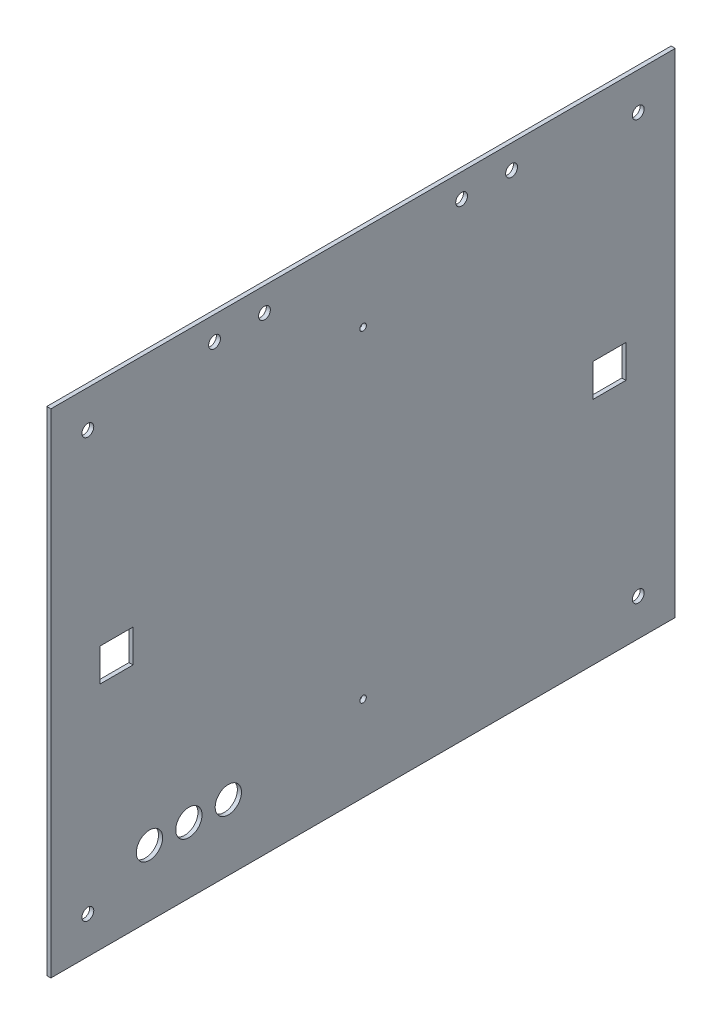
ISO-10303-21;
HEADER;
FILE_DESCRIPTION(('STEP AP214'),'2;1');
FILE_NAME('part.step','',(''),(''),'','','');
FILE_SCHEMA(('AUTOMOTIVE_DESIGN { 1 0 10303 214 1 1 1 1 }'));
ENDSEC;
DATA;
#1=APPLICATION_CONTEXT('core data for automotive mechanical design processes');
#2=APPLICATION_PROTOCOL_DEFINITION('international standard','automotive_design',2000,#1);
#3=PRODUCT_CONTEXT('',#1,'mechanical');
#4=PRODUCT('Part','Part','',(#3));
#5=PRODUCT_RELATED_PRODUCT_CATEGORY('part','',(#4));
#6=PRODUCT_DEFINITION_FORMATION('','',#4);
#7=PRODUCT_DEFINITION_CONTEXT('part definition',#1,'design');
#8=PRODUCT_DEFINITION('design','',#6,#7);
#9=PRODUCT_DEFINITION_SHAPE('','',#8);
#10=(LENGTH_UNIT() NAMED_UNIT(*) SI_UNIT(.MILLI.,.METRE.));
#11=(NAMED_UNIT(*) PLANE_ANGLE_UNIT() SI_UNIT($,.RADIAN.));
#12=(NAMED_UNIT(*) SI_UNIT($,.STERADIAN.) SOLID_ANGLE_UNIT());
#13=UNCERTAINTY_MEASURE_WITH_UNIT(LENGTH_MEASURE(1.E-05),#10,'distance_accuracy_value','');
#14=(GEOMETRIC_REPRESENTATION_CONTEXT(3) GLOBAL_UNCERTAINTY_ASSIGNED_CONTEXT((#13)) GLOBAL_UNIT_ASSIGNED_CONTEXT((#10,
#11,#12)) REPRESENTATION_CONTEXT('',''));
#15=CARTESIAN_POINT('',(0.,0.,0.));
#16=DIRECTION('',(0.,0.,1.));
#17=DIRECTION('',(1.,0.,0.));
#18=AXIS2_PLACEMENT_3D('',#15,#16,#17);
#19=CARTESIAN_POINT('',(1.5875,0.,0.));
#20=DIRECTION('',(0.,0.,-1.));
#21=DIRECTION('',(-1.,0.,0.));
#22=AXIS2_PLACEMENT_3D('',#19,#20,#21);
#23=PLANE('',#22);
#24=DIRECTION('',(0.,-1.,0.));
#25=VECTOR('',#24,1.);
#26=CARTESIAN_POINT('',(0.,0.,0.));
#27=LINE('',#26,#25);
#28=CARTESIAN_POINT('',(0.,190.5,0.));
#29=VERTEX_POINT('',#28);
#30=CARTESIAN_POINT('',(0.,0.,0.));
#31=VERTEX_POINT('',#30);
#32=EDGE_CURVE('E246',#29,#31,#27,.T.);
#33=ORIENTED_EDGE('',*,*,#32,.T.);
#34=DIRECTION('',(-1.,0.,0.));
#35=VECTOR('',#34,1.);
#36=CARTESIAN_POINT('',(1.5875,0.,0.));
#37=LINE('',#36,#35);
#38=CARTESIAN_POINT('',(1.5875,0.,0.));
#39=VERTEX_POINT('',#38);
#40=EDGE_CURVE('E11',#39,#31,#37,.T.);
#41=ORIENTED_EDGE('',*,*,#40,.F.);
#42=DIRECTION('',(0.,-1.,0.));
#43=VECTOR('',#42,1.);
#44=CARTESIAN_POINT('',(1.5875,0.,0.));
#45=LINE('',#44,#43);
#46=CARTESIAN_POINT('',(1.5875,190.5,0.));
#47=VERTEX_POINT('',#46);
#48=EDGE_CURVE('E249',#47,#39,#45,.T.);
#49=ORIENTED_EDGE('',*,*,#48,.F.);
#50=DIRECTION('',(-1.,0.,0.));
#51=VECTOR('',#50,1.);
#52=CARTESIAN_POINT('',(1.5875,190.5,0.));
#53=LINE('',#52,#51);
#54=EDGE_CURVE('E259',#47,#29,#53,.T.);
#55=ORIENTED_EDGE('',*,*,#54,.T.);
#56=EDGE_LOOP('',(#33,#41,#49,#55));
#57=FACE_BOUND('',#56,.T.);
#58=ADVANCED_FACE('F39',(#57),#23,.F.);
#59=CARTESIAN_POINT('',(1.5875,0.,0.));
#60=DIRECTION('',(0.,1.,0.));
#61=DIRECTION('',(0.,0.,1.));
#62=AXIS2_PLACEMENT_3D('',#59,#60,#61);
#63=PLANE('',#62);
#64=DIRECTION('',(0.,0.,-1.));
#65=VECTOR('',#64,1.);
#66=CARTESIAN_POINT('',(0.,0.,0.));
#67=LINE('',#66,#65);
#68=CARTESIAN_POINT('',(0.,0.,-241.3));
#69=VERTEX_POINT('',#68);
#70=EDGE_CURVE('E262',#31,#69,#67,.T.);
#71=ORIENTED_EDGE('',*,*,#70,.T.);
#72=DIRECTION('',(-1.,0.,0.));
#73=VECTOR('',#72,1.);
#74=CARTESIAN_POINT('',(1.5875,0.,-241.3));
#75=LINE('',#74,#73);
#76=CARTESIAN_POINT('',(1.5875,0.,-241.3));
#77=VERTEX_POINT('',#76);
#78=EDGE_CURVE('E46',#77,#69,#75,.T.);
#79=ORIENTED_EDGE('',*,*,#78,.F.);
#80=DIRECTION('',(0.,0.,-1.));
#81=VECTOR('',#80,1.);
#82=CARTESIAN_POINT('',(1.5875,0.,0.));
#83=LINE('',#82,#81);
#84=EDGE_CURVE('E252',#39,#77,#83,.T.);
#85=ORIENTED_EDGE('',*,*,#84,.F.);
#86=ORIENTED_EDGE('',*,*,#40,.T.);
#87=EDGE_LOOP('',(#71,#79,#85,#86));
#88=FACE_BOUND('',#87,.T.);
#89=ADVANCED_FACE('F291',(#88),#63,.F.);
#90=CARTESIAN_POINT('',(1.5875,0.,-241.3));
#91=DIRECTION('',(0.,0.,1.));
#92=DIRECTION('',(1.,0.,0.));
#93=AXIS2_PLACEMENT_3D('',#90,#91,#92);
#94=PLANE('',#93);
#95=DIRECTION('',(0.,1.,0.));
#96=VECTOR('',#95,1.);
#97=CARTESIAN_POINT('',(0.,0.,-241.3));
#98=LINE('',#97,#96);
#99=CARTESIAN_POINT('',(0.,190.5,-241.3));
#100=VERTEX_POINT('',#99);
#101=EDGE_CURVE('E264',#69,#100,#98,.T.);
#102=ORIENTED_EDGE('',*,*,#101,.T.);
#103=DIRECTION('',(-1.,0.,0.));
#104=VECTOR('',#103,1.);
#105=CARTESIAN_POINT('',(1.5875,190.5,-241.3));
#106=LINE('',#105,#104);
#107=CARTESIAN_POINT('',(1.5875,190.5,-241.3));
#108=VERTEX_POINT('',#107);
#109=EDGE_CURVE('E269',#108,#100,#106,.T.);
#110=ORIENTED_EDGE('',*,*,#109,.F.);
#111=DIRECTION('',(0.,1.,0.));
#112=VECTOR('',#111,1.);
#113=CARTESIAN_POINT('',(1.5875,0.,-241.3));
#114=LINE('',#113,#112);
#115=EDGE_CURVE('E255',#77,#108,#114,.T.);
#116=ORIENTED_EDGE('',*,*,#115,.F.);
#117=ORIENTED_EDGE('',*,*,#78,.T.);
#118=EDGE_LOOP('',(#102,#110,#116,#117));
#119=FACE_BOUND('',#118,.T.);
#120=ADVANCED_FACE('F276',(#119),#94,.F.);
#121=CARTESIAN_POINT('',(1.5875,190.5,0.));
#122=DIRECTION('',(0.,-1.,0.));
#123=DIRECTION('',(0.,0.,-1.));
#124=AXIS2_PLACEMENT_3D('',#121,#122,#123);
#125=PLANE('',#124);
#126=DIRECTION('',(0.,0.,1.));
#127=VECTOR('',#126,1.);
#128=CARTESIAN_POINT('',(0.,190.5,0.));
#129=LINE('',#128,#127);
#130=EDGE_CURVE('E253',#100,#29,#129,.T.);
#131=ORIENTED_EDGE('',*,*,#130,.T.);
#132=ORIENTED_EDGE('',*,*,#54,.F.);
#133=DIRECTION('',(0.,0.,1.));
#134=VECTOR('',#133,1.);
#135=CARTESIAN_POINT('',(1.5875,190.5,0.));
#136=LINE('',#135,#134);
#137=EDGE_CURVE('E257',#108,#47,#136,.T.);
#138=ORIENTED_EDGE('',*,*,#137,.F.);
#139=ORIENTED_EDGE('',*,*,#109,.T.);
#140=EDGE_LOOP('',(#131,#132,#138,#139));
#141=FACE_BOUND('',#140,.T.);
#142=ADVANCED_FACE('F284',(#141),#125,.F.);
#143=CARTESIAN_POINT('',(1.5875,0.,0.));
#144=DIRECTION('',(-1.,0.,0.));
#145=DIRECTION('',(0.,0.,1.));
#146=AXIS2_PLACEMENT_3D('',#143,#144,#145);
#147=PLANE('',#146);
#148=CARTESIAN_POINT('',(1.5875,25.4,-38.1));
#149=DIRECTION('',(1.,0.,0.));
#150=DIRECTION('',(0.,0.,-1.));
#151=AXIS2_PLACEMENT_3D('',#148,#149,#150);
#152=CIRCLE('',#151,5.08000000000001);
#153=CARTESIAN_POINT('',(1.5875,25.4,-43.18));
#154=VERTEX_POINT('',#153);
#155=EDGE_CURVE('E393',#154,#154,#152,.T.);
#156=ORIENTED_EDGE('',*,*,#155,.F.);
#157=EDGE_LOOP('',(#156));
#158=FACE_BOUND('',#157,.T.);
#159=CARTESIAN_POINT('',(1.5875,25.4,-53.34));
#160=DIRECTION('',(1.,0.,0.));
#161=DIRECTION('',(0.,0.,-1.));
#162=AXIS2_PLACEMENT_3D('',#159,#160,#161);
#163=CIRCLE('',#162,5.08000000000001);
#164=CARTESIAN_POINT('',(1.5875,25.4,-58.42));
#165=VERTEX_POINT('',#164);
#166=EDGE_CURVE('E398',#165,#165,#163,.T.);
#167=ORIENTED_EDGE('',*,*,#166,.F.);
#168=EDGE_LOOP('',(#167));
#169=FACE_BOUND('',#168,.T.);
#170=CARTESIAN_POINT('',(1.5875,25.4,-68.58));
#171=DIRECTION('',(1.,0.,0.));
#172=DIRECTION('',(0.,0.,-1.));
#173=AXIS2_PLACEMENT_3D('',#170,#171,#172);
#174=CIRCLE('',#173,5.08);
#175=CARTESIAN_POINT('',(1.5875,25.4,-73.66));
#176=VERTEX_POINT('',#175);
#177=EDGE_CURVE('E406',#176,#176,#174,.T.);
#178=ORIENTED_EDGE('',*,*,#177,.F.);
#179=EDGE_LOOP('',(#178));
#180=FACE_BOUND('',#179,.T.);
#181=CARTESIAN_POINT('',(1.5875,157.48,-120.65));
#182=DIRECTION('',(1.,0.,0.));
#183=DIRECTION('',(0.,0.,-1.));
#184=AXIS2_PLACEMENT_3D('',#181,#182,#183);
#185=CIRCLE('',#184,1.26999999999999);
#186=CARTESIAN_POINT('',(1.5875,157.48,-121.92));
#187=VERTEX_POINT('',#186);
#188=EDGE_CURVE('E411',#187,#187,#185,.T.);
#189=ORIENTED_EDGE('',*,*,#188,.F.);
#190=EDGE_LOOP('',(#189));
#191=FACE_BOUND('',#190,.T.);
#192=CARTESIAN_POINT('',(1.5875,33.02,-120.65));
#193=DIRECTION('',(1.,0.,0.));
#194=DIRECTION('',(0.,0.,-1.));
#195=AXIS2_PLACEMENT_3D('',#192,#193,#194);
#196=CIRCLE('',#195,1.26999999999999);
#197=CARTESIAN_POINT('',(1.5875,33.02,-121.92));
#198=VERTEX_POINT('',#197);
#199=EDGE_CURVE('E154',#198,#198,#196,.T.);
#200=ORIENTED_EDGE('',*,*,#199,.F.);
#201=EDGE_LOOP('',(#200));
#202=FACE_BOUND('',#201,.T.);
#203=DIRECTION('',(0.,0.,-1.));
#204=VECTOR('',#203,1.);
#205=CARTESIAN_POINT('',(1.5875,88.9,-19.05));
#206=LINE('',#205,#204);
#207=CARTESIAN_POINT('',(1.5875,88.9,-19.05));
#208=VERTEX_POINT('',#207);
#209=CARTESIAN_POINT('',(1.5875,88.9,-31.75));
#210=VERTEX_POINT('',#209);
#211=EDGE_CURVE('E160',#208,#210,#206,.T.);
#212=ORIENTED_EDGE('',*,*,#211,.F.);
#213=DIRECTION('',(0.,-1.,0.));
#214=VECTOR('',#213,1.);
#215=CARTESIAN_POINT('',(1.5875,101.6,-19.05));
#216=LINE('',#215,#214);
#217=CARTESIAN_POINT('',(1.5875,101.6,-19.05));
#218=VERTEX_POINT('',#217);
#219=EDGE_CURVE('E53',#218,#208,#216,.T.);
#220=ORIENTED_EDGE('',*,*,#219,.F.);
#221=DIRECTION('',(0.,0.,1.));
#222=VECTOR('',#221,1.);
#223=CARTESIAN_POINT('',(1.5875,101.6,-19.05));
#224=LINE('',#223,#222);
#225=CARTESIAN_POINT('',(1.5875,101.6,-31.75));
#226=VERTEX_POINT('',#225);
#227=EDGE_CURVE('E148',#226,#218,#224,.T.);
#228=ORIENTED_EDGE('',*,*,#227,.F.);
#229=DIRECTION('',(0.,1.,0.));
#230=VECTOR('',#229,1.);
#231=CARTESIAN_POINT('',(1.5875,101.6,-31.75));
#232=LINE('',#231,#230);
#233=EDGE_CURVE('E151',#210,#226,#232,.T.);
#234=ORIENTED_EDGE('',*,*,#233,.F.);
#235=EDGE_LOOP('',(#212,#220,#228,#234));
#236=FACE_BOUND('',#235,.T.);
#237=DIRECTION('',(0.,0.,-1.));
#238=VECTOR('',#237,1.);
#239=CARTESIAN_POINT('',(1.5875,88.9,-209.55));
#240=LINE('',#239,#238);
#241=CARTESIAN_POINT('',(1.5875,88.9,-209.55));
#242=VERTEX_POINT('',#241);
#243=CARTESIAN_POINT('',(1.5875,88.9,-222.25));
#244=VERTEX_POINT('',#243);
#245=EDGE_CURVE('E186',#242,#244,#240,.T.);
#246=ORIENTED_EDGE('',*,*,#245,.F.);
#247=DIRECTION('',(0.,-1.,0.));
#248=VECTOR('',#247,1.);
#249=CARTESIAN_POINT('',(1.5875,88.9,-209.55));
#250=LINE('',#249,#248);
#251=CARTESIAN_POINT('',(1.5875,101.6,-209.55));
#252=VERTEX_POINT('',#251);
#253=EDGE_CURVE('E61',#252,#242,#250,.T.);
#254=ORIENTED_EDGE('',*,*,#253,.F.);
#255=DIRECTION('',(0.,0.,1.));
#256=VECTOR('',#255,1.);
#257=CARTESIAN_POINT('',(1.5875,101.6,-209.55));
#258=LINE('',#257,#256);
#259=CARTESIAN_POINT('',(1.5875,101.6,-222.25));
#260=VERTEX_POINT('',#259);
#261=EDGE_CURVE('E175',#260,#252,#258,.T.);
#262=ORIENTED_EDGE('',*,*,#261,.F.);
#263=DIRECTION('',(0.,1.,0.));
#264=VECTOR('',#263,1.);
#265=CARTESIAN_POINT('',(1.5875,88.9,-222.25));
#266=LINE('',#265,#264);
#267=EDGE_CURVE('E190',#244,#260,#266,.T.);
#268=ORIENTED_EDGE('',*,*,#267,.F.);
#269=EDGE_LOOP('',(#246,#254,#262,#268));
#270=FACE_BOUND('',#269,.T.);
#271=CARTESIAN_POINT('',(1.5875,181.2925,-63.246));
#272=DIRECTION('',(1.,0.,0.));
#273=DIRECTION('',(0.,0.,-1.));
#274=AXIS2_PLACEMENT_3D('',#271,#272,#273);
#275=CIRCLE('',#274,2.28599999999998);
#276=CARTESIAN_POINT('',(1.5875,181.2925,-65.532));
#277=VERTEX_POINT('',#276);
#278=EDGE_CURVE('E205',#277,#277,#275,.T.);
#279=ORIENTED_EDGE('',*,*,#278,.F.);
#280=EDGE_LOOP('',(#279));
#281=FACE_BOUND('',#280,.T.);
#282=CARTESIAN_POINT('',(1.5875,181.2925,-82.55));
#283=DIRECTION('',(1.,0.,0.));
#284=DIRECTION('',(0.,0.,-1.));
#285=AXIS2_PLACEMENT_3D('',#282,#283,#284);
#286=CIRCLE('',#285,2.28599999999999);
#287=CARTESIAN_POINT('',(1.5875,181.2925,-84.836));
#288=VERTEX_POINT('',#287);
#289=EDGE_CURVE('E211',#288,#288,#286,.T.);
#290=ORIENTED_EDGE('',*,*,#289,.F.);
#291=EDGE_LOOP('',(#290));
#292=FACE_BOUND('',#291,.T.);
#293=CARTESIAN_POINT('',(1.5875,181.2925,-158.75));
#294=DIRECTION('',(1.,0.,0.));
#295=DIRECTION('',(0.,0.,-1.));
#296=AXIS2_PLACEMENT_3D('',#293,#294,#295);
#297=CIRCLE('',#296,2.28600000000001);
#298=CARTESIAN_POINT('',(1.5875,181.2925,-161.036));
#299=VERTEX_POINT('',#298);
#300=EDGE_CURVE('E217',#299,#299,#297,.T.);
#301=ORIENTED_EDGE('',*,*,#300,.F.);
#302=EDGE_LOOP('',(#301));
#303=FACE_BOUND('',#302,.T.);
#304=CARTESIAN_POINT('',(1.5875,181.2925,-178.054));
#305=DIRECTION('',(1.,0.,0.));
#306=DIRECTION('',(0.,0.,-1.));
#307=AXIS2_PLACEMENT_3D('',#304,#305,#306);
#308=CIRCLE('',#307,2.28600000000001);
#309=CARTESIAN_POINT('',(1.5875,181.2925,-180.34));
#310=VERTEX_POINT('',#309);
#311=EDGE_CURVE('E167',#310,#310,#308,.T.);
#312=ORIENTED_EDGE('',*,*,#311,.F.);
#313=EDGE_LOOP('',(#312));
#314=FACE_BOUND('',#313,.T.);
#315=CARTESIAN_POINT('',(1.5875,176.2125,-227.0125));
#316=DIRECTION('',(1.,0.,0.));
#317=DIRECTION('',(0.,0.,1.));
#318=AXIS2_PLACEMENT_3D('',#315,#316,#317);
#319=CIRCLE('',#318,2.28600000000001);
#320=CARTESIAN_POINT('',(1.5875,176.2125,-224.7265));
#321=VERTEX_POINT('',#320);
#322=EDGE_CURVE('E235',#321,#321,#319,.T.);
#323=ORIENTED_EDGE('',*,*,#322,.F.);
#324=EDGE_LOOP('',(#323));
#325=FACE_BOUND('',#324,.T.);
#326=CARTESIAN_POINT('',(1.5875,14.2875,-14.2875));
#327=DIRECTION('',(1.,0.,0.));
#328=DIRECTION('',(0.,0.,1.));
#329=AXIS2_PLACEMENT_3D('',#326,#327,#328);
#330=CIRCLE('',#329,2.28600000000001);
#331=CARTESIAN_POINT('',(1.5875,14.2875,-12.0015));
#332=VERTEX_POINT('',#331);
#333=EDGE_CURVE('E228',#332,#332,#330,.T.);
#334=ORIENTED_EDGE('',*,*,#333,.F.);
#335=EDGE_LOOP('',(#334));
#336=FACE_BOUND('',#335,.T.);
#337=CARTESIAN_POINT('',(1.5875,176.2125,-14.2875));
#338=DIRECTION('',(1.,0.,0.));
#339=DIRECTION('',(0.,0.,-1.));
#340=AXIS2_PLACEMENT_3D('',#337,#338,#339);
#341=CIRCLE('',#340,2.28600000000001);
#342=CARTESIAN_POINT('',(1.5875,176.2125,-16.5735));
#343=VERTEX_POINT('',#342);
#344=EDGE_CURVE('E204',#343,#343,#341,.T.);
#345=ORIENTED_EDGE('',*,*,#344,.F.);
#346=EDGE_LOOP('',(#345));
#347=FACE_BOUND('',#346,.T.);
#348=CARTESIAN_POINT('',(1.5875,14.2875,-227.0125));
#349=DIRECTION('',(1.,0.,0.));
#350=DIRECTION('',(0.,0.,-1.));
#351=AXIS2_PLACEMENT_3D('',#348,#349,#350);
#352=CIRCLE('',#351,2.28600000000001);
#353=CARTESIAN_POINT('',(1.5875,14.2875,-229.2985));
#354=VERTEX_POINT('',#353);
#355=EDGE_CURVE('E234',#354,#354,#352,.T.);
#356=ORIENTED_EDGE('',*,*,#355,.F.);
#357=EDGE_LOOP('',(#356));
#358=FACE_BOUND('',#357,.T.);
#359=ORIENTED_EDGE('',*,*,#48,.T.);
#360=ORIENTED_EDGE('',*,*,#84,.T.);
#361=ORIENTED_EDGE('',*,*,#115,.T.);
#362=ORIENTED_EDGE('',*,*,#137,.T.);
#363=EDGE_LOOP('',(#359,#360,#361,#362));
#364=FACE_BOUND('',#363,.T.);
#365=ADVANCED_FACE('F290',(#158,#169,#180,#191,#202,#236,#270,#281,#292,#303,#314,#325,#336,
#347,#358,#364),#147,.F.);
#366=CARTESIAN_POINT('',(0.,0.,0.));
#367=DIRECTION('',(-1.,0.,0.));
#368=DIRECTION('',(0.,0.,1.));
#369=AXIS2_PLACEMENT_3D('',#366,#367,#368);
#370=PLANE('',#369);
#371=CARTESIAN_POINT('',(0.,25.4,-38.1));
#372=DIRECTION('',(1.,0.,0.));
#373=DIRECTION('',(0.,0.,-1.));
#374=AXIS2_PLACEMENT_3D('',#371,#372,#373);
#375=CIRCLE('',#374,5.08000000000001);
#376=CARTESIAN_POINT('',(0.,25.4,-43.18));
#377=VERTEX_POINT('',#376);
#378=EDGE_CURVE('E390',#377,#377,#375,.T.);
#379=ORIENTED_EDGE('',*,*,#378,.T.);
#380=EDGE_LOOP('',(#379));
#381=FACE_BOUND('',#380,.T.);
#382=CARTESIAN_POINT('',(0.,25.4,-53.34));
#383=DIRECTION('',(1.,0.,0.));
#384=DIRECTION('',(0.,0.,-1.));
#385=AXIS2_PLACEMENT_3D('',#382,#383,#384);
#386=CIRCLE('',#385,5.08000000000001);
#387=CARTESIAN_POINT('',(0.,25.4,-58.42));
#388=VERTEX_POINT('',#387);
#389=EDGE_CURVE('E394',#388,#388,#386,.T.);
#390=ORIENTED_EDGE('',*,*,#389,.T.);
#391=EDGE_LOOP('',(#390));
#392=FACE_BOUND('',#391,.T.);
#393=CARTESIAN_POINT('',(0.,25.4,-68.58));
#394=DIRECTION('',(1.,0.,0.));
#395=DIRECTION('',(0.,0.,-1.));
#396=AXIS2_PLACEMENT_3D('',#393,#394,#395);
#397=CIRCLE('',#396,5.08);
#398=CARTESIAN_POINT('',(0.,25.4,-73.66));
#399=VERTEX_POINT('',#398);
#400=EDGE_CURVE('E403',#399,#399,#397,.T.);
#401=ORIENTED_EDGE('',*,*,#400,.T.);
#402=EDGE_LOOP('',(#401));
#403=FACE_BOUND('',#402,.T.);
#404=CARTESIAN_POINT('',(0.,157.48,-120.65));
#405=DIRECTION('',(1.,0.,0.));
#406=DIRECTION('',(0.,0.,-1.));
#407=AXIS2_PLACEMENT_3D('',#404,#405,#406);
#408=CIRCLE('',#407,1.26999999999999);
#409=CARTESIAN_POINT('',(0.,157.48,-121.92));
#410=VERTEX_POINT('',#409);
#411=EDGE_CURVE('E187',#410,#410,#408,.T.);
#412=ORIENTED_EDGE('',*,*,#411,.T.);
#413=EDGE_LOOP('',(#412));
#414=FACE_BOUND('',#413,.T.);
#415=CARTESIAN_POINT('',(0.,33.02,-120.65));
#416=DIRECTION('',(1.,0.,0.));
#417=DIRECTION('',(0.,0.,-1.));
#418=AXIS2_PLACEMENT_3D('',#415,#416,#417);
#419=CIRCLE('',#418,1.26999999999999);
#420=CARTESIAN_POINT('',(0.,33.02,-121.92));
#421=VERTEX_POINT('',#420);
#422=EDGE_CURVE('E413',#421,#421,#419,.T.);
#423=ORIENTED_EDGE('',*,*,#422,.T.);
#424=EDGE_LOOP('',(#423));
#425=FACE_BOUND('',#424,.T.);
#426=DIRECTION('',(0.,-1.,0.));
#427=VECTOR('',#426,1.);
#428=CARTESIAN_POINT('',(0.,101.6,-19.05));
#429=LINE('',#428,#427);
#430=CARTESIAN_POINT('',(0.,101.6,-19.05));
#431=VERTEX_POINT('',#430);
#432=CARTESIAN_POINT('',(0.,88.9,-19.05));
#433=VERTEX_POINT('',#432);
#434=EDGE_CURVE('E129',#431,#433,#429,.T.);
#435=ORIENTED_EDGE('',*,*,#434,.T.);
#436=DIRECTION('',(0.,0.,-1.));
#437=VECTOR('',#436,1.);
#438=CARTESIAN_POINT('',(0.,88.9,-19.05));
#439=LINE('',#438,#437);
#440=CARTESIAN_POINT('',(0.,88.9,-31.75));
#441=VERTEX_POINT('',#440);
#442=EDGE_CURVE('E139',#433,#441,#439,.T.);
#443=ORIENTED_EDGE('',*,*,#442,.T.);
#444=DIRECTION('',(0.,1.,0.));
#445=VECTOR('',#444,1.);
#446=CARTESIAN_POINT('',(0.,101.6,-31.75));
#447=LINE('',#446,#445);
#448=CARTESIAN_POINT('',(0.,101.6,-31.75));
#449=VERTEX_POINT('',#448);
#450=EDGE_CURVE('E143',#441,#449,#447,.T.);
#451=ORIENTED_EDGE('',*,*,#450,.T.);
#452=DIRECTION('',(0.,0.,1.));
#453=VECTOR('',#452,1.);
#454=CARTESIAN_POINT('',(0.,101.6,-19.05));
#455=LINE('',#454,#453);
#456=EDGE_CURVE('E135',#449,#431,#455,.T.);
#457=ORIENTED_EDGE('',*,*,#456,.T.);
#458=EDGE_LOOP('',(#435,#443,#451,#457));
#459=FACE_BOUND('',#458,.T.);
#460=DIRECTION('',(0.,-1.,0.));
#461=VECTOR('',#460,1.);
#462=CARTESIAN_POINT('',(0.,88.9,-209.55));
#463=LINE('',#462,#461);
#464=CARTESIAN_POINT('',(0.,101.6,-209.55));
#465=VERTEX_POINT('',#464);
#466=CARTESIAN_POINT('',(0.,88.9,-209.55));
#467=VERTEX_POINT('',#466);
#468=EDGE_CURVE('E171',#465,#467,#463,.T.);
#469=ORIENTED_EDGE('',*,*,#468,.T.);
#470=DIRECTION('',(0.,0.,-1.));
#471=VECTOR('',#470,1.);
#472=CARTESIAN_POINT('',(0.,88.9,-209.55));
#473=LINE('',#472,#471);
#474=CARTESIAN_POINT('',(0.,88.9,-222.25));
#475=VERTEX_POINT('',#474);
#476=EDGE_CURVE('E174',#467,#475,#473,.T.);
#477=ORIENTED_EDGE('',*,*,#476,.T.);
#478=DIRECTION('',(0.,1.,0.));
#479=VECTOR('',#478,1.);
#480=CARTESIAN_POINT('',(0.,88.9,-222.25));
#481=LINE('',#480,#479);
#482=CARTESIAN_POINT('',(0.,101.6,-222.25));
#483=VERTEX_POINT('',#482);
#484=EDGE_CURVE('E178',#475,#483,#481,.T.);
#485=ORIENTED_EDGE('',*,*,#484,.T.);
#486=DIRECTION('',(0.,0.,1.));
#487=VECTOR('',#486,1.);
#488=CARTESIAN_POINT('',(0.,101.6,-209.55));
#489=LINE('',#488,#487);
#490=EDGE_CURVE('E181',#483,#465,#489,.T.);
#491=ORIENTED_EDGE('',*,*,#490,.T.);
#492=EDGE_LOOP('',(#469,#477,#485,#491));
#493=FACE_BOUND('',#492,.T.);
#494=CARTESIAN_POINT('',(0.,181.2925,-63.246));
#495=DIRECTION('',(1.,0.,0.));
#496=DIRECTION('',(0.,0.,-1.));
#497=AXIS2_PLACEMENT_3D('',#494,#495,#496);
#498=CIRCLE('',#497,2.28599999999998);
#499=CARTESIAN_POINT('',(0.,181.2925,-65.532));
#500=VERTEX_POINT('',#499);
#501=EDGE_CURVE('E201',#500,#500,#498,.T.);
#502=ORIENTED_EDGE('',*,*,#501,.T.);
#503=EDGE_LOOP('',(#502));
#504=FACE_BOUND('',#503,.T.);
#505=CARTESIAN_POINT('',(0.,181.2925,-82.55));
#506=DIRECTION('',(1.,0.,0.));
#507=DIRECTION('',(0.,0.,-1.));
#508=AXIS2_PLACEMENT_3D('',#505,#506,#507);
#509=CIRCLE('',#508,2.28599999999999);
#510=CARTESIAN_POINT('',(0.,181.2925,-84.836));
#511=VERTEX_POINT('',#510);
#512=EDGE_CURVE('E208',#511,#511,#509,.T.);
#513=ORIENTED_EDGE('',*,*,#512,.T.);
#514=EDGE_LOOP('',(#513));
#515=FACE_BOUND('',#514,.T.);
#516=CARTESIAN_POINT('',(0.,181.2925,-158.75));
#517=DIRECTION('',(1.,0.,0.));
#518=DIRECTION('',(0.,0.,-1.));
#519=AXIS2_PLACEMENT_3D('',#516,#517,#518);
#520=CIRCLE('',#519,2.28600000000001);
#521=CARTESIAN_POINT('',(0.,181.2925,-161.036));
#522=VERTEX_POINT('',#521);
#523=EDGE_CURVE('E214',#522,#522,#520,.T.);
#524=ORIENTED_EDGE('',*,*,#523,.T.);
#525=EDGE_LOOP('',(#524));
#526=FACE_BOUND('',#525,.T.);
#527=CARTESIAN_POINT('',(0.,181.2925,-178.054));
#528=DIRECTION('',(1.,0.,0.));
#529=DIRECTION('',(0.,0.,-1.));
#530=AXIS2_PLACEMENT_3D('',#527,#528,#529);
#531=CIRCLE('',#530,2.28600000000001);
#532=CARTESIAN_POINT('',(0.,181.2925,-180.34));
#533=VERTEX_POINT('',#532);
#534=EDGE_CURVE('E220',#533,#533,#531,.T.);
#535=ORIENTED_EDGE('',*,*,#534,.T.);
#536=EDGE_LOOP('',(#535));
#537=FACE_BOUND('',#536,.T.);
#538=CARTESIAN_POINT('',(0.,176.2125,-227.0125));
#539=DIRECTION('',(1.,0.,0.));
#540=DIRECTION('',(0.,0.,1.));
#541=AXIS2_PLACEMENT_3D('',#538,#539,#540);
#542=CIRCLE('',#541,2.28600000000001);
#543=CARTESIAN_POINT('',(0.,176.2125,-224.7265));
#544=VERTEX_POINT('',#543);
#545=EDGE_CURVE('E231',#544,#544,#542,.T.);
#546=ORIENTED_EDGE('',*,*,#545,.T.);
#547=EDGE_LOOP('',(#546));
#548=FACE_BOUND('',#547,.T.);
#549=CARTESIAN_POINT('',(0.,14.2875,-14.2875));
#550=DIRECTION('',(1.,0.,0.));
#551=DIRECTION('',(0.,0.,1.));
#552=AXIS2_PLACEMENT_3D('',#549,#550,#551);
#553=CIRCLE('',#552,2.28600000000001);
#554=CARTESIAN_POINT('',(0.,14.2875,-12.0015));
#555=VERTEX_POINT('',#554);
#556=EDGE_CURVE('E238',#555,#555,#553,.T.);
#557=ORIENTED_EDGE('',*,*,#556,.T.);
#558=EDGE_LOOP('',(#557));
#559=FACE_BOUND('',#558,.T.);
#560=CARTESIAN_POINT('',(0.,176.2125,-14.2875));
#561=DIRECTION('',(1.,0.,0.));
#562=DIRECTION('',(0.,0.,-1.));
#563=AXIS2_PLACEMENT_3D('',#560,#561,#562);
#564=CIRCLE('',#563,2.28600000000001);
#565=CARTESIAN_POINT('',(0.,176.2125,-16.5735));
#566=VERTEX_POINT('',#565);
#567=EDGE_CURVE('E225',#566,#566,#564,.T.);
#568=ORIENTED_EDGE('',*,*,#567,.T.);
#569=EDGE_LOOP('',(#568));
#570=FACE_BOUND('',#569,.T.);
#571=CARTESIAN_POINT('',(0.,14.2875,-227.0125));
#572=DIRECTION('',(1.,0.,0.));
#573=DIRECTION('',(0.,0.,-1.));
#574=AXIS2_PLACEMENT_3D('',#571,#572,#573);
#575=CIRCLE('',#574,2.28600000000001);
#576=CARTESIAN_POINT('',(0.,14.2875,-229.2985));
#577=VERTEX_POINT('',#576);
#578=EDGE_CURVE('E243',#577,#577,#575,.T.);
#579=ORIENTED_EDGE('',*,*,#578,.T.);
#580=EDGE_LOOP('',(#579));
#581=FACE_BOUND('',#580,.T.);
#582=ORIENTED_EDGE('',*,*,#32,.F.);
#583=ORIENTED_EDGE('',*,*,#130,.F.);
#584=ORIENTED_EDGE('',*,*,#101,.F.);
#585=ORIENTED_EDGE('',*,*,#70,.F.);
#586=EDGE_LOOP('',(#582,#583,#584,#585));
#587=FACE_BOUND('',#586,.T.);
#588=ADVANCED_FACE('F145',(#381,#392,#403,#414,#425,#459,#493,#504,#515,#526,#537,#548,#559,
#570,#581,#587),#370,.T.);
#589=CARTESIAN_POINT('',(0.,14.2875,-227.0125));
#590=DIRECTION('',(1.,0.,0.));
#591=DIRECTION('',(0.,0.,-1.));
#592=AXIS2_PLACEMENT_3D('',#589,#590,#591);
#593=CYLINDRICAL_SURFACE('',#592,2.28600000000001);
#594=ORIENTED_EDGE('',*,*,#578,.F.);
#595=EDGE_LOOP('',(#594));
#596=FACE_BOUND('',#595,.T.);
#597=ORIENTED_EDGE('',*,*,#355,.T.);
#598=EDGE_LOOP('',(#597));
#599=FACE_BOUND('',#598,.T.);
#600=ADVANCED_FACE('F303',(#596,#599),#593,.F.);
#601=CARTESIAN_POINT('',(0.,176.2125,-14.2875));
#602=DIRECTION('',(1.,0.,0.));
#603=DIRECTION('',(0.,0.,-1.));
#604=AXIS2_PLACEMENT_3D('',#601,#602,#603);
#605=CYLINDRICAL_SURFACE('',#604,2.28600000000001);
#606=ORIENTED_EDGE('',*,*,#567,.F.);
#607=EDGE_LOOP('',(#606));
#608=FACE_BOUND('',#607,.T.);
#609=ORIENTED_EDGE('',*,*,#344,.T.);
#610=EDGE_LOOP('',(#609));
#611=FACE_BOUND('',#610,.T.);
#612=ADVANCED_FACE('F310',(#608,#611),#605,.F.);
#613=CARTESIAN_POINT('',(0.,14.2875,-14.2875));
#614=DIRECTION('',(1.,0.,0.));
#615=DIRECTION('',(0.,0.,-1.));
#616=AXIS2_PLACEMENT_3D('',#613,#614,#615);
#617=CYLINDRICAL_SURFACE('',#616,2.28600000000001);
#618=ORIENTED_EDGE('',*,*,#556,.F.);
#619=EDGE_LOOP('',(#618));
#620=FACE_BOUND('',#619,.T.);
#621=ORIENTED_EDGE('',*,*,#333,.T.);
#622=EDGE_LOOP('',(#621));
#623=FACE_BOUND('',#622,.T.);
#624=ADVANCED_FACE('F312',(#620,#623),#617,.F.);
#625=CARTESIAN_POINT('',(0.,176.2125,-227.0125));
#626=DIRECTION('',(1.,0.,0.));
#627=DIRECTION('',(0.,0.,-1.));
#628=AXIS2_PLACEMENT_3D('',#625,#626,#627);
#629=CYLINDRICAL_SURFACE('',#628,2.28600000000001);
#630=ORIENTED_EDGE('',*,*,#545,.F.);
#631=EDGE_LOOP('',(#630));
#632=FACE_BOUND('',#631,.T.);
#633=ORIENTED_EDGE('',*,*,#322,.T.);
#634=EDGE_LOOP('',(#633));
#635=FACE_BOUND('',#634,.T.);
#636=ADVANCED_FACE('F315',(#632,#635),#629,.F.);
#637=CARTESIAN_POINT('',(0.,181.2925,-178.054));
#638=DIRECTION('',(1.,0.,0.));
#639=DIRECTION('',(0.,0.,-1.));
#640=AXIS2_PLACEMENT_3D('',#637,#638,#639);
#641=CYLINDRICAL_SURFACE('',#640,2.28600000000001);
#642=ORIENTED_EDGE('',*,*,#534,.F.);
#643=EDGE_LOOP('',(#642));
#644=FACE_BOUND('',#643,.T.);
#645=ORIENTED_EDGE('',*,*,#311,.T.);
#646=EDGE_LOOP('',(#645));
#647=FACE_BOUND('',#646,.T.);
#648=ADVANCED_FACE('F319',(#644,#647),#641,.F.);
#649=CARTESIAN_POINT('',(0.,181.2925,-158.75));
#650=DIRECTION('',(1.,0.,0.));
#651=DIRECTION('',(0.,0.,-1.));
#652=AXIS2_PLACEMENT_3D('',#649,#650,#651);
#653=CYLINDRICAL_SURFACE('',#652,2.28600000000001);
#654=ORIENTED_EDGE('',*,*,#523,.F.);
#655=EDGE_LOOP('',(#654));
#656=FACE_BOUND('',#655,.T.);
#657=ORIENTED_EDGE('',*,*,#300,.T.);
#658=EDGE_LOOP('',(#657));
#659=FACE_BOUND('',#658,.T.);
#660=ADVANCED_FACE('F326',(#656,#659),#653,.F.);
#661=CARTESIAN_POINT('',(0.,181.2925,-82.55));
#662=DIRECTION('',(1.,0.,0.));
#663=DIRECTION('',(0.,0.,-1.));
#664=AXIS2_PLACEMENT_3D('',#661,#662,#663);
#665=CYLINDRICAL_SURFACE('',#664,2.28599999999999);
#666=ORIENTED_EDGE('',*,*,#512,.F.);
#667=EDGE_LOOP('',(#666));
#668=FACE_BOUND('',#667,.T.);
#669=ORIENTED_EDGE('',*,*,#289,.T.);
#670=EDGE_LOOP('',(#669));
#671=FACE_BOUND('',#670,.T.);
#672=ADVANCED_FACE('F330',(#668,#671),#665,.F.);
#673=CARTESIAN_POINT('',(0.,181.2925,-63.246));
#674=DIRECTION('',(1.,0.,0.));
#675=DIRECTION('',(0.,0.,-1.));
#676=AXIS2_PLACEMENT_3D('',#673,#674,#675);
#677=CYLINDRICAL_SURFACE('',#676,2.28599999999998);
#678=ORIENTED_EDGE('',*,*,#501,.F.);
#679=EDGE_LOOP('',(#678));
#680=FACE_BOUND('',#679,.T.);
#681=ORIENTED_EDGE('',*,*,#278,.T.);
#682=EDGE_LOOP('',(#681));
#683=FACE_BOUND('',#682,.T.);
#684=ADVANCED_FACE('F334',(#680,#683),#677,.F.);
#685=CARTESIAN_POINT('',(0.,88.9,-209.55));
#686=DIRECTION('',(0.,0.,1.));
#687=DIRECTION('',(1.,0.,0.));
#688=AXIS2_PLACEMENT_3D('',#685,#686,#687);
#689=PLANE('',#688);
#690=ORIENTED_EDGE('',*,*,#253,.T.);
#691=DIRECTION('',(1.,0.,0.));
#692=VECTOR('',#691,1.);
#693=CARTESIAN_POINT('',(0.,88.9,-209.55));
#694=LINE('',#693,#692);
#695=EDGE_CURVE('E184',#467,#242,#694,.T.);
#696=ORIENTED_EDGE('',*,*,#695,.F.);
#697=ORIENTED_EDGE('',*,*,#468,.F.);
#698=DIRECTION('',(1.,0.,0.));
#699=VECTOR('',#698,1.);
#700=CARTESIAN_POINT('',(0.,101.6,-209.55));
#701=LINE('',#700,#699);
#702=EDGE_CURVE('E161',#465,#252,#701,.T.);
#703=ORIENTED_EDGE('',*,*,#702,.T.);
#704=EDGE_LOOP('',(#690,#696,#697,#703));
#705=FACE_BOUND('',#704,.T.);
#706=ADVANCED_FACE('F338',(#705),#689,.F.);
#707=CARTESIAN_POINT('',(0.,101.6,-209.55));
#708=DIRECTION('',(0.,1.,0.));
#709=DIRECTION('',(0.,0.,1.));
#710=AXIS2_PLACEMENT_3D('',#707,#708,#709);
#711=PLANE('',#710);
#712=ORIENTED_EDGE('',*,*,#261,.T.);
#713=ORIENTED_EDGE('',*,*,#702,.F.);
#714=ORIENTED_EDGE('',*,*,#490,.F.);
#715=DIRECTION('',(1.,0.,0.));
#716=VECTOR('',#715,1.);
#717=CARTESIAN_POINT('',(0.,101.6,-222.25));
#718=LINE('',#717,#716);
#719=EDGE_CURVE('E196',#483,#260,#718,.T.);
#720=ORIENTED_EDGE('',*,*,#719,.T.);
#721=EDGE_LOOP('',(#712,#713,#714,#720));
#722=FACE_BOUND('',#721,.T.);
#723=ADVANCED_FACE('F342',(#722),#711,.F.);
#724=CARTESIAN_POINT('',(0.,88.9,-222.25));
#725=DIRECTION('',(0.,0.,-1.));
#726=DIRECTION('',(-1.,0.,0.));
#727=AXIS2_PLACEMENT_3D('',#724,#725,#726);
#728=PLANE('',#727);
#729=ORIENTED_EDGE('',*,*,#267,.T.);
#730=ORIENTED_EDGE('',*,*,#719,.F.);
#731=ORIENTED_EDGE('',*,*,#484,.F.);
#732=DIRECTION('',(1.,0.,0.));
#733=VECTOR('',#732,1.);
#734=CARTESIAN_POINT('',(0.,88.9,-222.25));
#735=LINE('',#734,#733);
#736=EDGE_CURVE('E198',#475,#244,#735,.T.);
#737=ORIENTED_EDGE('',*,*,#736,.T.);
#738=EDGE_LOOP('',(#729,#730,#731,#737));
#739=FACE_BOUND('',#738,.T.);
#740=ADVANCED_FACE('F346',(#739),#728,.F.);
#741=CARTESIAN_POINT('',(0.,88.9,-209.55));
#742=DIRECTION('',(0.,-1.,0.));
#743=DIRECTION('',(0.,0.,-1.));
#744=AXIS2_PLACEMENT_3D('',#741,#742,#743);
#745=PLANE('',#744);
#746=ORIENTED_EDGE('',*,*,#245,.T.);
#747=ORIENTED_EDGE('',*,*,#736,.F.);
#748=ORIENTED_EDGE('',*,*,#476,.F.);
#749=ORIENTED_EDGE('',*,*,#695,.T.);
#750=EDGE_LOOP('',(#746,#747,#748,#749));
#751=FACE_BOUND('',#750,.T.);
#752=ADVANCED_FACE('F343',(#751),#745,.F.);
#753=CARTESIAN_POINT('',(0.,101.6,-19.05));
#754=DIRECTION('',(0.,0.,1.));
#755=DIRECTION('',(1.,0.,0.));
#756=AXIS2_PLACEMENT_3D('',#753,#754,#755);
#757=PLANE('',#756);
#758=ORIENTED_EDGE('',*,*,#219,.T.);
#759=DIRECTION('',(1.,0.,0.));
#760=VECTOR('',#759,1.);
#761=CARTESIAN_POINT('',(0.,88.9,-19.05));
#762=LINE('',#761,#760);
#763=EDGE_CURVE('E125',#433,#208,#762,.T.);
#764=ORIENTED_EDGE('',*,*,#763,.F.);
#765=ORIENTED_EDGE('',*,*,#434,.F.);
#766=DIRECTION('',(1.,0.,0.));
#767=VECTOR('',#766,1.);
#768=CARTESIAN_POINT('',(0.,101.6,-19.05));
#769=LINE('',#768,#767);
#770=EDGE_CURVE('E165',#431,#218,#769,.T.);
#771=ORIENTED_EDGE('',*,*,#770,.T.);
#772=EDGE_LOOP('',(#758,#764,#765,#771));
#773=FACE_BOUND('',#772,.T.);
#774=ADVANCED_FACE('F127',(#773),#757,.F.);
#775=CARTESIAN_POINT('',(0.,101.6,-19.05));
#776=DIRECTION('',(0.,1.,0.));
#777=DIRECTION('',(0.,0.,1.));
#778=AXIS2_PLACEMENT_3D('',#775,#776,#777);
#779=PLANE('',#778);
#780=ORIENTED_EDGE('',*,*,#227,.T.);
#781=ORIENTED_EDGE('',*,*,#770,.F.);
#782=ORIENTED_EDGE('',*,*,#456,.F.);
#783=DIRECTION('',(1.,0.,0.));
#784=VECTOR('',#783,1.);
#785=CARTESIAN_POINT('',(0.,101.6,-31.75));
#786=LINE('',#785,#784);
#787=EDGE_CURVE('E168',#449,#226,#786,.T.);
#788=ORIENTED_EDGE('',*,*,#787,.T.);
#789=EDGE_LOOP('',(#780,#781,#782,#788));
#790=FACE_BOUND('',#789,.T.);
#791=ADVANCED_FACE('F356',(#790),#779,.F.);
#792=CARTESIAN_POINT('',(0.,101.6,-31.75));
#793=DIRECTION('',(0.,0.,-1.));
#794=DIRECTION('',(0.,1.,0.));
#795=AXIS2_PLACEMENT_3D('',#792,#793,#794);
#796=PLANE('',#795);
#797=ORIENTED_EDGE('',*,*,#233,.T.);
#798=ORIENTED_EDGE('',*,*,#787,.F.);
#799=ORIENTED_EDGE('',*,*,#450,.F.);
#800=DIRECTION('',(1.,0.,0.));
#801=VECTOR('',#800,1.);
#802=CARTESIAN_POINT('',(0.,88.9,-31.75));
#803=LINE('',#802,#801);
#804=EDGE_CURVE('E134',#441,#210,#803,.T.);
#805=ORIENTED_EDGE('',*,*,#804,.T.);
#806=EDGE_LOOP('',(#797,#798,#799,#805));
#807=FACE_BOUND('',#806,.T.);
#808=ADVANCED_FACE('F360',(#807),#796,.F.);
#809=CARTESIAN_POINT('',(0.,88.9,-19.05));
#810=DIRECTION('',(0.,-1.,0.));
#811=DIRECTION('',(0.,0.,-1.));
#812=AXIS2_PLACEMENT_3D('',#809,#810,#811);
#813=PLANE('',#812);
#814=ORIENTED_EDGE('',*,*,#211,.T.);
#815=ORIENTED_EDGE('',*,*,#804,.F.);
#816=ORIENTED_EDGE('',*,*,#442,.F.);
#817=ORIENTED_EDGE('',*,*,#763,.T.);
#818=EDGE_LOOP('',(#814,#815,#816,#817));
#819=FACE_BOUND('',#818,.T.);
#820=ADVANCED_FACE('F140',(#819),#813,.F.);
#821=CARTESIAN_POINT('',(0.,33.02,-120.65));
#822=DIRECTION('',(1.,0.,0.));
#823=DIRECTION('',(0.,0.,-1.));
#824=AXIS2_PLACEMENT_3D('',#821,#822,#823);
#825=CYLINDRICAL_SURFACE('',#824,1.26999999999999);
#826=ORIENTED_EDGE('',*,*,#422,.F.);
#827=EDGE_LOOP('',(#826));
#828=FACE_BOUND('',#827,.T.);
#829=ORIENTED_EDGE('',*,*,#199,.T.);
#830=EDGE_LOOP('',(#829));
#831=FACE_BOUND('',#830,.T.);
#832=ADVANCED_FACE('F359',(#828,#831),#825,.F.);
#833=CARTESIAN_POINT('',(0.,157.48,-120.65));
#834=DIRECTION('',(1.,0.,0.));
#835=DIRECTION('',(0.,0.,-1.));
#836=AXIS2_PLACEMENT_3D('',#833,#834,#835);
#837=CYLINDRICAL_SURFACE('',#836,1.26999999999999);
#838=ORIENTED_EDGE('',*,*,#411,.F.);
#839=EDGE_LOOP('',(#838));
#840=FACE_BOUND('',#839,.T.);
#841=ORIENTED_EDGE('',*,*,#188,.T.);
#842=EDGE_LOOP('',(#841));
#843=FACE_BOUND('',#842,.T.);
#844=ADVANCED_FACE('F369',(#840,#843),#837,.F.);
#845=CARTESIAN_POINT('',(0.,25.4,-68.58));
#846=DIRECTION('',(1.,0.,0.));
#847=DIRECTION('',(0.,0.,-1.));
#848=AXIS2_PLACEMENT_3D('',#845,#846,#847);
#849=CYLINDRICAL_SURFACE('',#848,5.08);
#850=ORIENTED_EDGE('',*,*,#400,.F.);
#851=EDGE_LOOP('',(#850));
#852=FACE_BOUND('',#851,.T.);
#853=ORIENTED_EDGE('',*,*,#177,.T.);
#854=EDGE_LOOP('',(#853));
#855=FACE_BOUND('',#854,.T.);
#856=ADVANCED_FACE('F373',(#852,#855),#849,.F.);
#857=CARTESIAN_POINT('',(0.,25.4,-53.34));
#858=DIRECTION('',(1.,0.,0.));
#859=DIRECTION('',(0.,0.,-1.));
#860=AXIS2_PLACEMENT_3D('',#857,#858,#859);
#861=CYLINDRICAL_SURFACE('',#860,5.08000000000001);
#862=ORIENTED_EDGE('',*,*,#389,.F.);
#863=EDGE_LOOP('',(#862));
#864=FACE_BOUND('',#863,.T.);
#865=ORIENTED_EDGE('',*,*,#166,.T.);
#866=EDGE_LOOP('',(#865));
#867=FACE_BOUND('',#866,.T.);
#868=ADVANCED_FACE('F377',(#864,#867),#861,.F.);
#869=CARTESIAN_POINT('',(0.,25.4,-38.1));
#870=DIRECTION('',(1.,0.,0.));
#871=DIRECTION('',(0.,0.,-1.));
#872=AXIS2_PLACEMENT_3D('',#869,#870,#871);
#873=CYLINDRICAL_SURFACE('',#872,5.08000000000001);
#874=ORIENTED_EDGE('',*,*,#378,.F.);
#875=EDGE_LOOP('',(#874));
#876=FACE_BOUND('',#875,.T.);
#877=ORIENTED_EDGE('',*,*,#155,.T.);
#878=EDGE_LOOP('',(#877));
#879=FACE_BOUND('',#878,.T.);
#880=ADVANCED_FACE('F381',(#876,#879),#873,.F.);
#881=CLOSED_SHELL('',(#58,#89,#120,#142,#365,#588,#600,#612,#624,#636,#648,#660,#672,#684,#706,
#723,#740,#752,#774,#791,#808,#820,#832,#844,#856,#868,#880));
#882=MANIFOLD_SOLID_BREP('B2',#881);
#883=ADVANCED_BREP_SHAPE_REPRESENTATION('',(#18,#882),#14);
#884=SHAPE_DEFINITION_REPRESENTATION(#9,#883);
ENDSEC;
END-ISO-10303-21;
